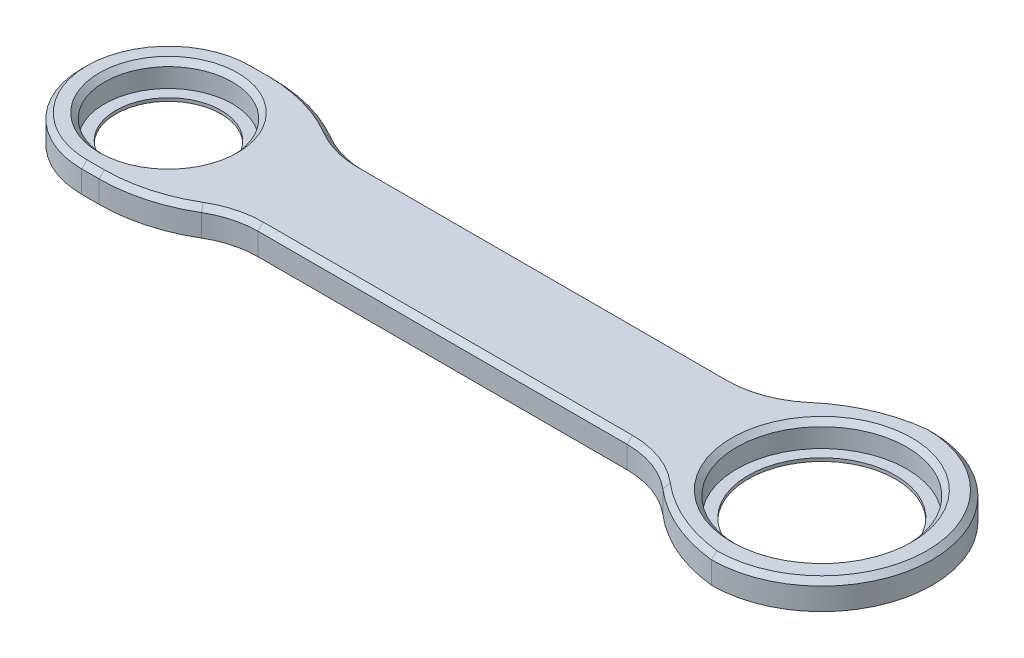
ISO-10303-21;
HEADER;
FILE_DESCRIPTION(('STEP AP214'),'2;1');
FILE_NAME('part.step','',(''),(''),'','','');
FILE_SCHEMA(('AUTOMOTIVE_DESIGN { 1 0 10303 214 1 1 1 1 }'));
ENDSEC;
DATA;
#1=APPLICATION_CONTEXT('core data for automotive mechanical design processes');
#2=APPLICATION_PROTOCOL_DEFINITION('international standard','automotive_design',2000,#1);
#3=PRODUCT_CONTEXT('',#1,'mechanical');
#4=PRODUCT('Part','Part','',(#3));
#5=PRODUCT_RELATED_PRODUCT_CATEGORY('part','',(#4));
#6=PRODUCT_DEFINITION_FORMATION('','',#4);
#7=PRODUCT_DEFINITION_CONTEXT('part definition',#1,'design');
#8=PRODUCT_DEFINITION('design','',#6,#7);
#9=PRODUCT_DEFINITION_SHAPE('','',#8);
#10=(LENGTH_UNIT() NAMED_UNIT(*) SI_UNIT(.MILLI.,.METRE.));
#11=(NAMED_UNIT(*) PLANE_ANGLE_UNIT() SI_UNIT($,.RADIAN.));
#12=(NAMED_UNIT(*) SI_UNIT($,.STERADIAN.) SOLID_ANGLE_UNIT());
#13=UNCERTAINTY_MEASURE_WITH_UNIT(LENGTH_MEASURE(1.E-05),#10,'distance_accuracy_value','');
#14=(GEOMETRIC_REPRESENTATION_CONTEXT(3) GLOBAL_UNCERTAINTY_ASSIGNED_CONTEXT((#13)) GLOBAL_UNIT_ASSIGNED_CONTEXT((#10,
#11,#12)) REPRESENTATION_CONTEXT('',''));
#15=CARTESIAN_POINT('',(0.,0.,0.));
#16=DIRECTION('',(0.,0.,1.));
#17=DIRECTION('',(1.,0.,0.));
#18=AXIS2_PLACEMENT_3D('',#15,#16,#17);
#19=CARTESIAN_POINT('',(62.125,5.2,0.));
#20=DIRECTION('',(0.,-1.,0.));
#21=DIRECTION('',(0.,0.,-1.));
#22=AXIS2_PLACEMENT_3D('',#19,#20,#21);
#23=CYLINDRICAL_SURFACE('',#22,16.15);
#24=CARTESIAN_POINT('',(62.125,4.19999999999999,0.));
#25=DIRECTION('',(0.,1.,0.));
#26=DIRECTION('',(0.,0.,1.));
#27=AXIS2_PLACEMENT_3D('',#24,#25,#26);
#28=CIRCLE('',#27,16.15);
#29=CARTESIAN_POINT('',(62.125,4.19999999999999,16.15));
#30=VERTEX_POINT('',#29);
#31=EDGE_CURVE('E316',#30,#30,#28,.T.);
#32=ORIENTED_EDGE('',*,*,#31,.T.);
#33=EDGE_LOOP('',(#32));
#34=FACE_BOUND('',#33,.T.);
#35=CARTESIAN_POINT('',(62.125,0.6,0.));
#36=DIRECTION('',(0.,-1.,0.));
#37=DIRECTION('',(0.,0.,-1.));
#38=AXIS2_PLACEMENT_3D('',#35,#36,#37);
#39=CIRCLE('',#38,16.15);
#40=CARTESIAN_POINT('',(62.125,0.6,-16.15));
#41=VERTEX_POINT('',#40);
#42=EDGE_CURVE('E46',#41,#41,#39,.T.);
#43=ORIENTED_EDGE('',*,*,#42,.T.);
#44=EDGE_LOOP('',(#43));
#45=FACE_BOUND('',#44,.T.);
#46=ADVANCED_FACE('F41',(#34,#45),#23,.F.);
#47=CARTESIAN_POINT('',(-62.125,5.2,0.));
#48=DIRECTION('',(0.,-1.,0.));
#49=DIRECTION('',(0.,0.,-1.));
#50=AXIS2_PLACEMENT_3D('',#47,#48,#49);
#51=CYLINDRICAL_SURFACE('',#50,12.15);
#52=CARTESIAN_POINT('',(-62.125,4.2,0.));
#53=DIRECTION('',(0.,1.,0.));
#54=DIRECTION('',(0.,0.,1.));
#55=AXIS2_PLACEMENT_3D('',#52,#53,#54);
#56=CIRCLE('',#55,12.15);
#57=CARTESIAN_POINT('',(-62.125,4.2,12.15));
#58=VERTEX_POINT('',#57);
#59=EDGE_CURVE('E319',#58,#58,#56,.T.);
#60=ORIENTED_EDGE('',*,*,#59,.T.);
#61=EDGE_LOOP('',(#60));
#62=FACE_BOUND('',#61,.T.);
#63=CARTESIAN_POINT('',(-62.125,0.6,0.));
#64=DIRECTION('',(0.,-1.,0.));
#65=DIRECTION('',(0.,0.,-1.));
#66=AXIS2_PLACEMENT_3D('',#63,#64,#65);
#67=CIRCLE('',#66,12.15);
#68=CARTESIAN_POINT('',(-62.125,0.6,-12.15));
#69=VERTEX_POINT('',#68);
#70=EDGE_CURVE('E351',#69,#69,#67,.T.);
#71=ORIENTED_EDGE('',*,*,#70,.T.);
#72=EDGE_LOOP('',(#71));
#73=FACE_BOUND('',#72,.T.);
#74=ADVANCED_FACE('F469',(#62,#73),#51,.F.);
#75=CARTESIAN_POINT('',(35.1066134191231,5.2,26.5457507457693));
#76=DIRECTION('',(0.,-1.,0.));
#77=DIRECTION('',(0.,0.,-1.));
#78=AXIS2_PLACEMENT_3D('',#75,#76,#77);
#79=CYLINDRICAL_SURFACE('',#78,16.5457507457693);
#80=DIRECTION('',(0.,-1.,0.));
#81=VECTOR('',#80,1.);
#82=CARTESIAN_POINT('',(45.8618438003382,5.2,13.9724899440475));
#83=LINE('',#82,#81);
#84=CARTESIAN_POINT('',(45.8618438003382,0.,13.9724899440475));
#85=VERTEX_POINT('',#84);
#86=CARTESIAN_POINT('',(45.8618438003382,4.2,13.9724899440475));
#87=VERTEX_POINT('',#86);
#88=EDGE_CURVE('E274',#85,#87,#83,.F.);
#89=ORIENTED_EDGE('',*,*,#88,.T.);
#90=CARTESIAN_POINT('',(35.1066134191231,4.2,26.5457507457693));
#91=DIRECTION('',(0.,1.,0.));
#92=DIRECTION('',(0.,0.,1.));
#93=AXIS2_PLACEMENT_3D('',#90,#91,#92);
#94=CIRCLE('',#93,16.5457507457693);
#95=CARTESIAN_POINT('',(35.106613419123,4.2,9.99999999999998));
#96=VERTEX_POINT('',#95);
#97=EDGE_CURVE('E51',#87,#96,#94,.T.);
#98=ORIENTED_EDGE('',*,*,#97,.T.);
#99=DIRECTION('',(0.,-1.,0.));
#100=VECTOR('',#99,1.);
#101=CARTESIAN_POINT('',(35.106613419123,5.2,9.99999999999998));
#102=LINE('',#101,#100);
#103=CARTESIAN_POINT('',(35.106613419123,0.,9.99999999999998));
#104=VERTEX_POINT('',#103);
#105=EDGE_CURVE('E241',#96,#104,#102,.T.);
#106=ORIENTED_EDGE('',*,*,#105,.T.);
#107=CARTESIAN_POINT('',(35.1066134191231,0.,26.5457507457693));
#108=DIRECTION('',(0.,1.,0.));
#109=DIRECTION('',(0.,0.,1.));
#110=AXIS2_PLACEMENT_3D('',#107,#108,#109);
#111=CIRCLE('',#110,16.5457507457693);
#112=EDGE_CURVE('E219',#85,#104,#111,.T.);
#113=ORIENTED_EDGE('',*,*,#112,.F.);
#114=EDGE_LOOP('',(#89,#98,#106,#113));
#115=FACE_BOUND('',#114,.T.);
#116=ADVANCED_FACE('F475',(#115),#79,.F.);
#117=CARTESIAN_POINT('',(62.125,5.2,0.));
#118=DIRECTION('',(0.,-1.,0.));
#119=DIRECTION('',(0.,0.,-1.));
#120=AXIS2_PLACEMENT_3D('',#117,#118,#119);
#121=CYLINDRICAL_SURFACE('',#120,21.);
#122=DIRECTION('',(0.,-1.,0.));
#123=VECTOR('',#122,1.);
#124=CARTESIAN_POINT('',(62.125,5.2,-21.));
#125=LINE('',#124,#123);
#126=CARTESIAN_POINT('',(62.125,4.2,-21.));
#127=VERTEX_POINT('',#126);
#128=CARTESIAN_POINT('',(62.125,0.,-21.));
#129=VERTEX_POINT('',#128);
#130=EDGE_CURVE('E249',#127,#129,#125,.T.);
#131=ORIENTED_EDGE('',*,*,#130,.F.);
#132=CARTESIAN_POINT('',(62.125,4.2,0.));
#133=DIRECTION('',(0.,1.,0.));
#134=DIRECTION('',(0.,0.,1.));
#135=AXIS2_PLACEMENT_3D('',#132,#133,#134);
#136=CIRCLE('',#135,21.);
#137=CARTESIAN_POINT('',(62.125,4.2,21.));
#138=VERTEX_POINT('',#137);
#139=EDGE_CURVE('E311',#127,#138,#136,.F.);
#140=ORIENTED_EDGE('',*,*,#139,.T.);
#141=DIRECTION('',(0.,-1.,0.));
#142=VECTOR('',#141,1.);
#143=CARTESIAN_POINT('',(62.125,5.2,21.));
#144=LINE('',#143,#142);
#145=CARTESIAN_POINT('',(62.125,0.,21.));
#146=VERTEX_POINT('',#145);
#147=EDGE_CURVE('E251',#138,#146,#144,.T.);
#148=ORIENTED_EDGE('',*,*,#147,.T.);
#149=CARTESIAN_POINT('',(62.125,0.,0.));
#150=DIRECTION('',(0.,1.,0.));
#151=DIRECTION('',(0.,0.,1.));
#152=AXIS2_PLACEMENT_3D('',#149,#150,#151);
#153=CIRCLE('',#152,21.);
#154=EDGE_CURVE('E223',#146,#129,#153,.T.);
#155=ORIENTED_EDGE('',*,*,#154,.T.);
#156=EDGE_LOOP('',(#131,#140,#148,#155));
#157=FACE_BOUND('',#156,.T.);
#158=ADVANCED_FACE('F504',(#157),#121,.T.);
#159=CARTESIAN_POINT('',(35.1066134191231,5.2,-26.5457507457693));
#160=DIRECTION('',(0.,-1.,0.));
#161=DIRECTION('',(0.,0.,-1.));
#162=AXIS2_PLACEMENT_3D('',#159,#160,#161);
#163=CYLINDRICAL_SURFACE('',#162,16.5457507457693);
#164=DIRECTION('',(0.,-1.,0.));
#165=VECTOR('',#164,1.);
#166=CARTESIAN_POINT('',(35.106613419123,5.2,-9.99999999999999));
#167=LINE('',#166,#165);
#168=CARTESIAN_POINT('',(35.106613419123,4.2,-9.99999999999999));
#169=VERTEX_POINT('',#168);
#170=CARTESIAN_POINT('',(35.106613419123,0.,-9.99999999999999));
#171=VERTEX_POINT('',#170);
#172=EDGE_CURVE('E247',#169,#171,#167,.T.);
#173=ORIENTED_EDGE('',*,*,#172,.F.);
#174=CARTESIAN_POINT('',(35.1066134191231,4.2,-26.5457507457693));
#175=DIRECTION('',(0.,1.,0.));
#176=DIRECTION('',(0.,0.,1.));
#177=AXIS2_PLACEMENT_3D('',#174,#175,#176);
#178=CIRCLE('',#177,16.5457507457693);
#179=CARTESIAN_POINT('',(45.8618438003381,4.2,-13.9724899440475));
#180=VERTEX_POINT('',#179);
#181=EDGE_CURVE('E324',#169,#180,#178,.T.);
#182=ORIENTED_EDGE('',*,*,#181,.T.);
#183=DIRECTION('',(0.,-1.,0.));
#184=VECTOR('',#183,1.);
#185=CARTESIAN_POINT('',(45.8618438003381,5.2,-13.9724899440475));
#186=LINE('',#185,#184);
#187=CARTESIAN_POINT('',(45.8618438003381,0.,-13.9724899440475));
#188=VERTEX_POINT('',#187);
#189=EDGE_CURVE('E272',#180,#188,#186,.T.);
#190=ORIENTED_EDGE('',*,*,#189,.T.);
#191=CARTESIAN_POINT('',(35.1066134191231,0.,-26.5457507457693));
#192=DIRECTION('',(0.,1.,0.));
#193=DIRECTION('',(0.,0.,1.));
#194=AXIS2_PLACEMENT_3D('',#191,#192,#193);
#195=CIRCLE('',#194,16.5457507457693);
#196=EDGE_CURVE('E226',#171,#188,#195,.T.);
#197=ORIENTED_EDGE('',*,*,#196,.F.);
#198=EDGE_LOOP('',(#173,#182,#190,#197));
#199=FACE_BOUND('',#198,.T.);
#200=ADVANCED_FACE('F612',(#199),#163,.F.);
#201=CARTESIAN_POINT('',(0.,5.2,-9.99999999999999));
#202=DIRECTION('',(0.,0.,-1.));
#203=DIRECTION('',(-1.,0.,0.));
#204=AXIS2_PLACEMENT_3D('',#201,#202,#203);
#205=PLANE('',#204);
#206=DIRECTION('',(0.,-1.,0.));
#207=VECTOR('',#206,1.);
#208=CARTESIAN_POINT('',(-35.106613419123,5.2,-9.99999999999999));
#209=LINE('',#208,#207);
#210=CARTESIAN_POINT('',(-35.106613419123,4.2,-9.99999999999999));
#211=VERTEX_POINT('',#210);
#212=CARTESIAN_POINT('',(-35.106613419123,0.,-9.99999999999999));
#213=VERTEX_POINT('',#212);
#214=EDGE_CURVE('E245',#211,#213,#209,.T.);
#215=ORIENTED_EDGE('',*,*,#214,.F.);
#216=DIRECTION('',(1.,0.,0.));
#217=VECTOR('',#216,1.);
#218=CARTESIAN_POINT('',(0.,4.20000000000001,-9.99999999999999));
#219=LINE('',#218,#217);
#220=EDGE_CURVE('E314',#211,#169,#219,.T.);
#221=ORIENTED_EDGE('',*,*,#220,.T.);
#222=ORIENTED_EDGE('',*,*,#172,.T.);
#223=DIRECTION('',(1.,0.,0.));
#224=VECTOR('',#223,1.);
#225=CARTESIAN_POINT('',(0.,0.,-9.99999999999999));
#226=LINE('',#225,#224);
#227=EDGE_CURVE('E229',#213,#171,#226,.T.);
#228=ORIENTED_EDGE('',*,*,#227,.F.);
#229=EDGE_LOOP('',(#215,#221,#222,#228));
#230=FACE_BOUND('',#229,.T.);
#231=ADVANCED_FACE('F608',(#230),#205,.T.);
#232=CARTESIAN_POINT('',(-35.1066134191231,5.2,-26.5457507457693));
#233=DIRECTION('',(0.,-1.,0.));
#234=DIRECTION('',(0.,0.,-1.));
#235=AXIS2_PLACEMENT_3D('',#232,#233,#234);
#236=CYLINDRICAL_SURFACE('',#235,16.5457507457693);
#237=DIRECTION('',(0.,-1.,0.));
#238=VECTOR('',#237,1.);
#239=CARTESIAN_POINT('',(-43.5399755911029,5.2,-12.3105735351637));
#240=LINE('',#239,#238);
#241=CARTESIAN_POINT('',(-43.5399755911029,0.,-12.3105735351637));
#242=VERTEX_POINT('',#241);
#243=CARTESIAN_POINT('',(-43.5399755911029,4.2,-12.3105735351637));
#244=VERTEX_POINT('',#243);
#245=EDGE_CURVE('E264',#242,#244,#240,.F.);
#246=ORIENTED_EDGE('',*,*,#245,.T.);
#247=CARTESIAN_POINT('',(-35.1066134191231,4.2,-26.5457507457693));
#248=DIRECTION('',(0.,1.,0.));
#249=DIRECTION('',(0.,0.,1.));
#250=AXIS2_PLACEMENT_3D('',#247,#248,#249);
#251=CIRCLE('',#250,16.5457507457693);
#252=EDGE_CURVE('E326',#244,#211,#251,.T.);
#253=ORIENTED_EDGE('',*,*,#252,.T.);
#254=ORIENTED_EDGE('',*,*,#214,.T.);
#255=CARTESIAN_POINT('',(-35.1066134191231,0.,-26.5457507457693));
#256=DIRECTION('',(0.,1.,0.));
#257=DIRECTION('',(0.,0.,1.));
#258=AXIS2_PLACEMENT_3D('',#255,#256,#257);
#259=CIRCLE('',#258,16.5457507457693);
#260=EDGE_CURVE('E232',#242,#213,#259,.T.);
#261=ORIENTED_EDGE('',*,*,#260,.F.);
#262=EDGE_LOOP('',(#246,#253,#254,#261));
#263=FACE_BOUND('',#262,.T.);
#264=ADVANCED_FACE('F604',(#263),#236,.F.);
#265=CARTESIAN_POINT('',(-35.1066134191231,5.2,26.5457507457693));
#266=DIRECTION('',(0.,-1.,0.));
#267=DIRECTION('',(0.,0.,-1.));
#268=AXIS2_PLACEMENT_3D('',#265,#266,#267);
#269=CYLINDRICAL_SURFACE('',#268,16.5457507457693);
#270=DIRECTION('',(0.,-1.,0.));
#271=VECTOR('',#270,1.);
#272=CARTESIAN_POINT('',(-35.106613419123,5.2,9.99999999999998));
#273=LINE('',#272,#271);
#274=CARTESIAN_POINT('',(-35.106613419123,4.2,9.99999999999998));
#275=VERTEX_POINT('',#274);
#276=CARTESIAN_POINT('',(-35.106613419123,0.,9.99999999999998));
#277=VERTEX_POINT('',#276);
#278=EDGE_CURVE('E243',#275,#277,#273,.T.);
#279=ORIENTED_EDGE('',*,*,#278,.F.);
#280=CARTESIAN_POINT('',(-35.1066134191231,4.2,26.5457507457693));
#281=DIRECTION('',(0.,1.,0.));
#282=DIRECTION('',(0.,0.,1.));
#283=AXIS2_PLACEMENT_3D('',#280,#281,#282);
#284=CIRCLE('',#283,16.5457507457693);
#285=CARTESIAN_POINT('',(-43.5399755911029,4.2,12.3105735351637));
#286=VERTEX_POINT('',#285);
#287=EDGE_CURVE('E339',#275,#286,#284,.T.);
#288=ORIENTED_EDGE('',*,*,#287,.T.);
#289=DIRECTION('',(0.,-1.,0.));
#290=VECTOR('',#289,1.);
#291=CARTESIAN_POINT('',(-43.5399755911029,5.2,12.3105735351637));
#292=LINE('',#291,#290);
#293=CARTESIAN_POINT('',(-43.5399755911029,0.,12.3105735351637));
#294=VERTEX_POINT('',#293);
#295=EDGE_CURVE('E270',#286,#294,#292,.T.);
#296=ORIENTED_EDGE('',*,*,#295,.T.);
#297=CARTESIAN_POINT('',(-35.1066134191231,0.,26.5457507457693));
#298=DIRECTION('',(0.,1.,0.));
#299=DIRECTION('',(0.,0.,1.));
#300=AXIS2_PLACEMENT_3D('',#297,#298,#299);
#301=CIRCLE('',#300,16.5457507457693);
#302=EDGE_CURVE('E235',#277,#294,#301,.T.);
#303=ORIENTED_EDGE('',*,*,#302,.F.);
#304=EDGE_LOOP('',(#279,#288,#296,#303));
#305=FACE_BOUND('',#304,.T.);
#306=ADVANCED_FACE('F601',(#305),#269,.F.);
#307=CARTESIAN_POINT('',(0.,5.2,9.99999999999998));
#308=DIRECTION('',(0.,0.,-1.));
#309=DIRECTION('',(-1.,0.,0.));
#310=AXIS2_PLACEMENT_3D('',#307,#308,#309);
#311=PLANE('',#310);
#312=ORIENTED_EDGE('',*,*,#105,.F.);
#313=DIRECTION('',(-1.,0.,0.));
#314=VECTOR('',#313,1.);
#315=CARTESIAN_POINT('',(-35.106613419123,4.2,9.99999999999998));
#316=LINE('',#315,#314);
#317=EDGE_CURVE('E11',#96,#275,#316,.T.);
#318=ORIENTED_EDGE('',*,*,#317,.T.);
#319=ORIENTED_EDGE('',*,*,#278,.T.);
#320=DIRECTION('',(1.,0.,0.));
#321=VECTOR('',#320,1.);
#322=CARTESIAN_POINT('',(0.,0.,9.99999999999998));
#323=LINE('',#322,#321);
#324=EDGE_CURVE('E238',#277,#104,#323,.T.);
#325=ORIENTED_EDGE('',*,*,#324,.T.);
#326=EDGE_LOOP('',(#312,#318,#319,#325));
#327=FACE_BOUND('',#326,.T.);
#328=ADVANCED_FACE('F595',(#327),#311,.F.);
#329=CARTESIAN_POINT('',(0.,5.2,0.));
#330=DIRECTION('',(0.,1.,0.));
#331=DIRECTION('',(0.,0.,1.));
#332=AXIS2_PLACEMENT_3D('',#329,#330,#331);
#333=PLANE('',#332);
#334=CARTESIAN_POINT('',(62.125,5.2,0.));
#335=DIRECTION('',(0.,1.,0.));
#336=DIRECTION('',(0.,0.,1.));
#337=AXIS2_PLACEMENT_3D('',#334,#335,#336);
#338=CIRCLE('',#337,17.15);
#339=CARTESIAN_POINT('',(62.125,5.2,17.15));
#340=VERTEX_POINT('',#339);
#341=EDGE_CURVE('E308',#340,#340,#338,.F.);
#342=ORIENTED_EDGE('',*,*,#341,.T.);
#343=EDGE_LOOP('',(#342));
#344=FACE_BOUND('',#343,.T.);
#345=CARTESIAN_POINT('',(-62.125,5.2,0.));
#346=DIRECTION('',(0.,1.,0.));
#347=DIRECTION('',(0.,0.,1.));
#348=AXIS2_PLACEMENT_3D('',#345,#346,#347);
#349=CIRCLE('',#348,13.15);
#350=CARTESIAN_POINT('',(-62.125,5.2,13.15));
#351=VERTEX_POINT('',#350);
#352=EDGE_CURVE('E305',#351,#351,#349,.F.);
#353=ORIENTED_EDGE('',*,*,#352,.T.);
#354=EDGE_LOOP('',(#353));
#355=FACE_BOUND('',#354,.T.);
#356=CARTESIAN_POINT('',(62.125,5.2,0.));
#357=DIRECTION('',(0.,1.,0.));
#358=DIRECTION('',(0.,0.,1.));
#359=AXIS2_PLACEMENT_3D('',#356,#357,#358);
#360=CIRCLE('',#359,20.);
#361=CARTESIAN_POINT('',(62.1789222081054,5.2,19.9999273097547));
#362=VERTEX_POINT('',#361);
#363=CARTESIAN_POINT('',(62.1789222081054,5.2,-19.9999273097547));
#364=VERTEX_POINT('',#363);
#365=EDGE_CURVE('E298',#362,#364,#360,.T.);
#366=ORIENTED_EDGE('',*,*,#365,.T.);
#367=CARTESIAN_POINT('',(65.3627365911324,5.2,8.82477261885566));
#368=DIRECTION('',(0.,1.,0.));
#369=DIRECTION('',(0.,0.,1.));
#370=AXIS2_PLACEMENT_3D('',#367,#368,#369);
#371=CIRCLE('',#370,29.);
#372=CARTESIAN_POINT('',(46.5118735600313,5.2,-13.2125811919507));
#373=VERTEX_POINT('',#372);
#374=EDGE_CURVE('E303',#364,#373,#371,.T.);
#375=ORIENTED_EDGE('',*,*,#374,.T.);
#376=CARTESIAN_POINT('',(35.1066134191231,5.2,-26.5457507457693));
#377=DIRECTION('',(0.,1.,0.));
#378=DIRECTION('',(0.,0.,1.));
#379=AXIS2_PLACEMENT_3D('',#376,#377,#378);
#380=CIRCLE('',#379,17.5457507457693);
#381=CARTESIAN_POINT('',(35.106613419123,5.2,-8.99999999999999));
#382=VERTEX_POINT('',#381);
#383=EDGE_CURVE('E301',#373,#382,#380,.F.);
#384=ORIENTED_EDGE('',*,*,#383,.T.);
#385=DIRECTION('',(-1.,0.,0.));
#386=VECTOR('',#385,1.);
#387=CARTESIAN_POINT('',(0.,5.2,-8.99999999999999));
#388=LINE('',#387,#386);
#389=CARTESIAN_POINT('',(-35.106613419123,5.2,-9.));
#390=VERTEX_POINT('',#389);
#391=EDGE_CURVE('E296',#382,#390,#388,.T.);
#392=ORIENTED_EDGE('',*,*,#391,.T.);
#393=CARTESIAN_POINT('',(-35.1066134191231,5.2,-26.5457507457693));
#394=DIRECTION('',(0.,1.,0.));
#395=DIRECTION('',(0.,0.,1.));
#396=AXIS2_PLACEMENT_3D('',#393,#394,#395);
#397=CIRCLE('',#396,17.5457507457693);
#398=CARTESIAN_POINT('',(-44.0496751690526,5.2,-11.4502210839916));
#399=VERTEX_POINT('',#398);
#400=EDGE_CURVE('E294',#390,#399,#397,.F.);
#401=ORIENTED_EDGE('',*,*,#400,.T.);
#402=CARTESIAN_POINT('',(-58.8309629295944,5.2,13.5));
#403=DIRECTION('',(0.,1.,0.));
#404=DIRECTION('',(0.,0.,1.));
#405=AXIS2_PLACEMENT_3D('',#402,#403,#404);
#406=CIRCLE('',#405,29.);
#407=CARTESIAN_POINT('',(-58.8309629295944,5.2,-15.5));
#408=VERTEX_POINT('',#407);
#409=EDGE_CURVE('E292',#399,#408,#406,.T.);
#410=ORIENTED_EDGE('',*,*,#409,.T.);
#411=DIRECTION('',(-1.,0.,0.));
#412=VECTOR('',#411,1.);
#413=CARTESIAN_POINT('',(-62.125,5.2,-15.5));
#414=LINE('',#413,#412);
#415=CARTESIAN_POINT('',(-62.125,5.2,-15.5));
#416=VERTEX_POINT('',#415);
#417=EDGE_CURVE('E290',#408,#416,#414,.T.);
#418=ORIENTED_EDGE('',*,*,#417,.T.);
#419=CARTESIAN_POINT('',(-62.125,5.2,0.));
#420=DIRECTION('',(0.,1.,0.));
#421=DIRECTION('',(0.,0.,1.));
#422=AXIS2_PLACEMENT_3D('',#419,#420,#421);
#423=CIRCLE('',#422,15.5);
#424=CARTESIAN_POINT('',(-62.125,5.2,15.5));
#425=VERTEX_POINT('',#424);
#426=EDGE_CURVE('E288',#416,#425,#423,.T.);
#427=ORIENTED_EDGE('',*,*,#426,.T.);
#428=DIRECTION('',(1.,0.,0.));
#429=VECTOR('',#428,1.);
#430=CARTESIAN_POINT('',(-58.8309629295944,5.2,15.5));
#431=LINE('',#430,#429);
#432=CARTESIAN_POINT('',(-58.8309629295944,5.2,15.5));
#433=VERTEX_POINT('',#432);
#434=EDGE_CURVE('E286',#425,#433,#431,.T.);
#435=ORIENTED_EDGE('',*,*,#434,.T.);
#436=CARTESIAN_POINT('',(-58.8309629295944,5.2,-13.5));
#437=DIRECTION('',(0.,1.,0.));
#438=DIRECTION('',(0.,0.,1.));
#439=AXIS2_PLACEMENT_3D('',#436,#437,#438);
#440=CIRCLE('',#439,29.);
#441=CARTESIAN_POINT('',(-44.0496751690526,5.2,11.4502210839916));
#442=VERTEX_POINT('',#441);
#443=EDGE_CURVE('E284',#433,#442,#440,.T.);
#444=ORIENTED_EDGE('',*,*,#443,.T.);
#445=CARTESIAN_POINT('',(-35.1066134191231,5.2,26.5457507457693));
#446=DIRECTION('',(0.,1.,0.));
#447=DIRECTION('',(0.,0.,1.));
#448=AXIS2_PLACEMENT_3D('',#445,#446,#447);
#449=CIRCLE('',#448,17.5457507457693);
#450=CARTESIAN_POINT('',(-35.106613419123,5.2,8.99999999999999));
#451=VERTEX_POINT('',#450);
#452=EDGE_CURVE('E280',#442,#451,#449,.F.);
#453=ORIENTED_EDGE('',*,*,#452,.T.);
#454=DIRECTION('',(1.,0.,0.));
#455=VECTOR('',#454,1.);
#456=CARTESIAN_POINT('',(35.106613419123,5.2,8.99999999999999));
#457=LINE('',#456,#455);
#458=CARTESIAN_POINT('',(35.106613419123,5.2,8.99999999999999));
#459=VERTEX_POINT('',#458);
#460=EDGE_CURVE('E276',#451,#459,#457,.T.);
#461=ORIENTED_EDGE('',*,*,#460,.T.);
#462=CARTESIAN_POINT('',(35.1066134191231,5.2,26.5457507457693));
#463=DIRECTION('',(0.,1.,0.));
#464=DIRECTION('',(0.,0.,1.));
#465=AXIS2_PLACEMENT_3D('',#462,#463,#464);
#466=CIRCLE('',#465,17.5457507457693);
#467=CARTESIAN_POINT('',(46.5118735600313,5.2,13.2125811919508));
#468=VERTEX_POINT('',#467);
#469=EDGE_CURVE('E278',#459,#468,#466,.F.);
#470=ORIENTED_EDGE('',*,*,#469,.T.);
#471=CARTESIAN_POINT('',(65.3627365911325,5.2,-8.82477261885563));
#472=DIRECTION('',(0.,1.,0.));
#473=DIRECTION('',(0.,0.,1.));
#474=AXIS2_PLACEMENT_3D('',#471,#472,#473);
#475=CIRCLE('',#474,29.);
#476=EDGE_CURVE('E282',#468,#362,#475,.T.);
#477=ORIENTED_EDGE('',*,*,#476,.T.);
#478=EDGE_LOOP('',(#366,#375,#384,#392,#401,#410,#418,#427,#435,#444,#453,#461,#470,#477));
#479=FACE_BOUND('',#478,.T.);
#480=ADVANCED_FACE('F517',(#344,#355,#479),#333,.T.);
#481=CARTESIAN_POINT('',(0.,0.,0.));
#482=DIRECTION('',(0.,1.,0.));
#483=DIRECTION('',(0.,0.,1.));
#484=AXIS2_PLACEMENT_3D('',#481,#482,#483);
#485=PLANE('',#484);
#486=DIRECTION('',(1.,0.,0.));
#487=VECTOR('',#486,1.);
#488=CARTESIAN_POINT('',(-62.125,0.,-16.5));
#489=LINE('',#488,#487);
#490=CARTESIAN_POINT('',(-62.125,0.,-16.5));
#491=VERTEX_POINT('',#490);
#492=CARTESIAN_POINT('',(-58.8309629295944,0.,-16.5));
#493=VERTEX_POINT('',#492);
#494=EDGE_CURVE('E196',#491,#493,#489,.T.);
#495=ORIENTED_EDGE('',*,*,#494,.T.);
#496=CARTESIAN_POINT('',(-58.8309629295944,0.,13.5));
#497=DIRECTION('',(0.,1.,0.));
#498=DIRECTION('',(0.,0.,1.));
#499=AXIS2_PLACEMENT_3D('',#496,#497,#498);
#500=CIRCLE('',#499,30.);
#501=EDGE_CURVE('E262',#493,#242,#500,.F.);
#502=ORIENTED_EDGE('',*,*,#501,.T.);
#503=ORIENTED_EDGE('',*,*,#260,.T.);
#504=ORIENTED_EDGE('',*,*,#227,.T.);
#505=ORIENTED_EDGE('',*,*,#196,.T.);
#506=CARTESIAN_POINT('',(65.3627365911324,0.,8.82477261885566));
#507=DIRECTION('',(0.,1.,0.));
#508=DIRECTION('',(0.,0.,1.));
#509=AXIS2_PLACEMENT_3D('',#506,#507,#508);
#510=CIRCLE('',#509,30.);
#511=EDGE_CURVE('E257',#188,#129,#510,.F.);
#512=ORIENTED_EDGE('',*,*,#511,.T.);
#513=ORIENTED_EDGE('',*,*,#154,.F.);
#514=CARTESIAN_POINT('',(65.3627365911325,0.,-8.82477261885563));
#515=DIRECTION('',(0.,1.,0.));
#516=DIRECTION('',(0.,0.,1.));
#517=AXIS2_PLACEMENT_3D('',#514,#515,#516);
#518=CIRCLE('',#517,30.);
#519=EDGE_CURVE('E255',#146,#85,#518,.F.);
#520=ORIENTED_EDGE('',*,*,#519,.T.);
#521=ORIENTED_EDGE('',*,*,#112,.T.);
#522=ORIENTED_EDGE('',*,*,#324,.F.);
#523=ORIENTED_EDGE('',*,*,#302,.T.);
#524=CARTESIAN_POINT('',(-58.8309629295944,0.,-13.5));
#525=DIRECTION('',(0.,1.,0.));
#526=DIRECTION('',(0.,0.,1.));
#527=AXIS2_PLACEMENT_3D('',#524,#525,#526);
#528=CIRCLE('',#527,30.);
#529=CARTESIAN_POINT('',(-58.8309629295944,0.,16.5));
#530=VERTEX_POINT('',#529);
#531=EDGE_CURVE('E260',#294,#530,#528,.F.);
#532=ORIENTED_EDGE('',*,*,#531,.T.);
#533=DIRECTION('',(-1.,0.,0.));
#534=VECTOR('',#533,1.);
#535=CARTESIAN_POINT('',(0.,0.,16.5));
#536=LINE('',#535,#534);
#537=CARTESIAN_POINT('',(-62.125,0.,16.5));
#538=VERTEX_POINT('',#537);
#539=EDGE_CURVE('E208',#530,#538,#536,.T.);
#540=ORIENTED_EDGE('',*,*,#539,.T.);
#541=CARTESIAN_POINT('',(-62.125,0.,0.));
#542=DIRECTION('',(0.,-1.,0.));
#543=DIRECTION('',(0.,0.,1.));
#544=AXIS2_PLACEMENT_3D('',#541,#542,#543);
#545=CIRCLE('',#544,16.5);
#546=EDGE_CURVE('E190',#538,#491,#545,.T.);
#547=ORIENTED_EDGE('',*,*,#546,.T.);
#548=EDGE_LOOP('',(#495,#502,#503,#504,#505,#512,#513,#520,#521,#522,#523,#532,#540,#547));
#549=FACE_BOUND('',#548,.T.);
#550=CARTESIAN_POINT('',(-62.125,0.,0.));
#551=DIRECTION('',(0.,-1.,0.));
#552=DIRECTION('',(0.,0.,-1.));
#553=AXIS2_PLACEMENT_3D('',#550,#551,#552);
#554=CIRCLE('',#553,10.);
#555=CARTESIAN_POINT('',(-62.125,0.,-9.99999999999999));
#556=VERTEX_POINT('',#555);
#557=EDGE_CURVE('E216',#556,#556,#554,.T.);
#558=ORIENTED_EDGE('',*,*,#557,.F.);
#559=EDGE_LOOP('',(#558));
#560=FACE_BOUND('',#559,.T.);
#561=CARTESIAN_POINT('',(62.125,0.,0.));
#562=DIRECTION('',(0.,-1.,0.));
#563=DIRECTION('',(0.,0.,-1.));
#564=AXIS2_PLACEMENT_3D('',#561,#562,#563);
#565=CIRCLE('',#564,14.);
#566=CARTESIAN_POINT('',(62.125,0.,-14.));
#567=VERTEX_POINT('',#566);
#568=EDGE_CURVE('E559',#567,#567,#565,.T.);
#569=ORIENTED_EDGE('',*,*,#568,.F.);
#570=EDGE_LOOP('',(#569));
#571=FACE_BOUND('',#570,.T.);
#572=ADVANCED_FACE('F205',(#549,#560,#571),#485,.F.);
#573=CARTESIAN_POINT('',(-62.125,0.,0.));
#574=DIRECTION('',(0.,1.,0.));
#575=DIRECTION('',(0.,0.,1.));
#576=AXIS2_PLACEMENT_3D('',#573,#574,#575);
#577=CYLINDRICAL_SURFACE('',#576,16.5);
#578=DIRECTION('',(0.,1.,0.));
#579=VECTOR('',#578,1.);
#580=CARTESIAN_POINT('',(-62.125,0.,16.5));
#581=LINE('',#580,#579);
#582=CARTESIAN_POINT('',(-62.125,4.2,16.5));
#583=VERTEX_POINT('',#582);
#584=EDGE_CURVE('E195',#538,#583,#581,.T.);
#585=ORIENTED_EDGE('',*,*,#584,.T.);
#586=CARTESIAN_POINT('',(-62.125,4.2,0.));
#587=DIRECTION('',(0.,1.,0.));
#588=DIRECTION('',(0.,0.,1.));
#589=AXIS2_PLACEMENT_3D('',#586,#587,#588);
#590=CIRCLE('',#589,16.5);
#591=CARTESIAN_POINT('',(-62.125,4.2,-16.5));
#592=VERTEX_POINT('',#591);
#593=EDGE_CURVE('E192',#583,#592,#590,.F.);
#594=ORIENTED_EDGE('',*,*,#593,.T.);
#595=DIRECTION('',(0.,1.,0.));
#596=VECTOR('',#595,1.);
#597=CARTESIAN_POINT('',(-62.125,0.,-16.5));
#598=LINE('',#597,#596);
#599=EDGE_CURVE('E185',#491,#592,#598,.T.);
#600=ORIENTED_EDGE('',*,*,#599,.F.);
#601=ORIENTED_EDGE('',*,*,#546,.F.);
#602=EDGE_LOOP('',(#585,#594,#600,#601));
#603=FACE_BOUND('',#602,.T.);
#604=ADVANCED_FACE('F188',(#603),#577,.T.);
#605=CARTESIAN_POINT('',(-38.9705431978449,0.,16.5));
#606=DIRECTION('',(0.,0.,-1.));
#607=DIRECTION('',(-1.,0.,0.));
#608=AXIS2_PLACEMENT_3D('',#605,#606,#607);
#609=PLANE('',#608);
#610=DIRECTION('',(0.,1.,0.));
#611=VECTOR('',#610,1.);
#612=CARTESIAN_POINT('',(-58.8309629295944,5.2,16.5));
#613=LINE('',#612,#611);
#614=CARTESIAN_POINT('',(-58.8309629295944,4.2,16.5));
#615=VERTEX_POINT('',#614);
#616=EDGE_CURVE('E267',#530,#615,#613,.T.);
#617=ORIENTED_EDGE('',*,*,#616,.T.);
#618=DIRECTION('',(-1.,0.,0.));
#619=VECTOR('',#618,1.);
#620=CARTESIAN_POINT('',(-62.125,4.2,16.5));
#621=LINE('',#620,#619);
#622=EDGE_CURVE('E333',#615,#583,#621,.T.);
#623=ORIENTED_EDGE('',*,*,#622,.T.);
#624=ORIENTED_EDGE('',*,*,#584,.F.);
#625=ORIENTED_EDGE('',*,*,#539,.F.);
#626=EDGE_LOOP('',(#617,#623,#624,#625));
#627=FACE_BOUND('',#626,.T.);
#628=ADVANCED_FACE('F585',(#627),#609,.F.);
#629=CARTESIAN_POINT('',(-62.125,0.,-16.5));
#630=DIRECTION('',(0.,0.,1.));
#631=DIRECTION('',(1.,0.,0.));
#632=AXIS2_PLACEMENT_3D('',#629,#630,#631);
#633=PLANE('',#632);
#634=ORIENTED_EDGE('',*,*,#599,.T.);
#635=DIRECTION('',(1.,0.,0.));
#636=VECTOR('',#635,1.);
#637=CARTESIAN_POINT('',(-58.8309629295944,4.2,-16.5));
#638=LINE('',#637,#636);
#639=CARTESIAN_POINT('',(-58.8309629295944,4.2,-16.5));
#640=VERTEX_POINT('',#639);
#641=EDGE_CURVE('E330',#592,#640,#638,.T.);
#642=ORIENTED_EDGE('',*,*,#641,.T.);
#643=DIRECTION('',(0.,1.,0.));
#644=VECTOR('',#643,1.);
#645=CARTESIAN_POINT('',(-58.8309629295944,0.,-16.5));
#646=LINE('',#645,#644);
#647=EDGE_CURVE('E201',#640,#493,#646,.F.);
#648=ORIENTED_EDGE('',*,*,#647,.T.);
#649=ORIENTED_EDGE('',*,*,#494,.F.);
#650=EDGE_LOOP('',(#634,#642,#648,#649));
#651=FACE_BOUND('',#650,.T.);
#652=ADVANCED_FACE('F199',(#651),#633,.F.);
#653=CARTESIAN_POINT('',(-58.8309629295944,5.2,13.5));
#654=DIRECTION('',(0.,-1.,0.));
#655=DIRECTION('',(0.,0.,-1.));
#656=AXIS2_PLACEMENT_3D('',#653,#654,#655);
#657=CYLINDRICAL_SURFACE('',#656,30.);
#658=ORIENTED_EDGE('',*,*,#647,.F.);
#659=CARTESIAN_POINT('',(-58.8309629295944,4.2,13.5));
#660=DIRECTION('',(0.,1.,0.));
#661=DIRECTION('',(0.,0.,1.));
#662=AXIS2_PLACEMENT_3D('',#659,#660,#661);
#663=CIRCLE('',#662,30.);
#664=EDGE_CURVE('E328',#640,#244,#663,.F.);
#665=ORIENTED_EDGE('',*,*,#664,.T.);
#666=ORIENTED_EDGE('',*,*,#245,.F.);
#667=ORIENTED_EDGE('',*,*,#501,.F.);
#668=EDGE_LOOP('',(#658,#665,#666,#667));
#669=FACE_BOUND('',#668,.T.);
#670=ADVANCED_FACE('F482',(#669),#657,.T.);
#671=CARTESIAN_POINT('',(-58.8309629295944,5.2,-13.5));
#672=DIRECTION('',(0.,-1.,0.));
#673=DIRECTION('',(0.,0.,-1.));
#674=AXIS2_PLACEMENT_3D('',#671,#672,#673);
#675=CYLINDRICAL_SURFACE('',#674,30.);
#676=ORIENTED_EDGE('',*,*,#295,.F.);
#677=CARTESIAN_POINT('',(-58.8309629295944,4.2,-13.5));
#678=DIRECTION('',(0.,1.,0.));
#679=DIRECTION('',(0.,0.,1.));
#680=AXIS2_PLACEMENT_3D('',#677,#678,#679);
#681=CIRCLE('',#680,30.);
#682=EDGE_CURVE('E335',#286,#615,#681,.F.);
#683=ORIENTED_EDGE('',*,*,#682,.T.);
#684=ORIENTED_EDGE('',*,*,#616,.F.);
#685=ORIENTED_EDGE('',*,*,#531,.F.);
#686=EDGE_LOOP('',(#676,#683,#684,#685));
#687=FACE_BOUND('',#686,.T.);
#688=ADVANCED_FACE('F485',(#687),#675,.T.);
#689=CARTESIAN_POINT('',(65.3627365911324,5.2,8.82477261885566));
#690=DIRECTION('',(0.,-1.,0.));
#691=DIRECTION('',(0.,0.,-1.));
#692=AXIS2_PLACEMENT_3D('',#689,#690,#691);
#693=CYLINDRICAL_SURFACE('',#692,30.);
#694=ORIENTED_EDGE('',*,*,#189,.F.);
#695=CARTESIAN_POINT('',(65.3627365911324,4.2,8.82477261885566));
#696=DIRECTION('',(0.,1.,0.));
#697=DIRECTION('',(0.,0.,1.));
#698=AXIS2_PLACEMENT_3D('',#695,#696,#697);
#699=CIRCLE('',#698,30.);
#700=EDGE_CURVE('E322',#180,#127,#699,.F.);
#701=ORIENTED_EDGE('',*,*,#700,.T.);
#702=ORIENTED_EDGE('',*,*,#130,.T.);
#703=ORIENTED_EDGE('',*,*,#511,.F.);
#704=EDGE_LOOP('',(#694,#701,#702,#703));
#705=FACE_BOUND('',#704,.T.);
#706=ADVANCED_FACE('F489',(#705),#693,.T.);
#707=CARTESIAN_POINT('',(65.3627365911325,5.2,-8.82477261885563));
#708=DIRECTION('',(0.,-1.,0.));
#709=DIRECTION('',(0.,0.,-1.));
#710=AXIS2_PLACEMENT_3D('',#707,#708,#709);
#711=CYLINDRICAL_SURFACE('',#710,30.);
#712=ORIENTED_EDGE('',*,*,#147,.F.);
#713=CARTESIAN_POINT('',(65.3627365911325,4.2,-8.82477261885563));
#714=DIRECTION('',(0.,1.,0.));
#715=DIRECTION('',(0.,0.,1.));
#716=AXIS2_PLACEMENT_3D('',#713,#714,#715);
#717=CIRCLE('',#716,30.);
#718=EDGE_CURVE('E337',#138,#87,#717,.F.);
#719=ORIENTED_EDGE('',*,*,#718,.T.);
#720=ORIENTED_EDGE('',*,*,#88,.F.);
#721=ORIENTED_EDGE('',*,*,#519,.F.);
#722=EDGE_LOOP('',(#712,#719,#720,#721));
#723=FACE_BOUND('',#722,.T.);
#724=ADVANCED_FACE('F454',(#723),#711,.T.);
#725=CARTESIAN_POINT('',(-62.125,4.2,0.));
#726=DIRECTION('',(0.,-1.,0.));
#727=DIRECTION('',(0.,0.,-1.));
#728=AXIS2_PLACEMENT_3D('',#725,#726,#727);
#729=CONICAL_SURFACE('',#728,16.5,0.785398163397441);
#730=DIRECTION('',(0.,0.707106781186552,0.707106781186543));
#731=VECTOR('',#730,1.);
#732=CARTESIAN_POINT('',(-62.125,4.2,-16.5));
#733=LINE('',#732,#731);
#734=EDGE_CURVE('E213',#592,#416,#733,.T.);
#735=ORIENTED_EDGE('',*,*,#734,.F.);
#736=ORIENTED_EDGE('',*,*,#593,.F.);
#737=DIRECTION('',(0.,-0.707106781186552,0.707106781186543));
#738=VECTOR('',#737,1.);
#739=CARTESIAN_POINT('',(-62.125,5.2,15.5));
#740=LINE('',#739,#738);
#741=EDGE_CURVE('E210',#425,#583,#740,.T.);
#742=ORIENTED_EDGE('',*,*,#741,.F.);
#743=ORIENTED_EDGE('',*,*,#426,.F.);
#744=EDGE_LOOP('',(#735,#736,#742,#743));
#745=FACE_BOUND('',#744,.T.);
#746=ADVANCED_FACE('F449',(#745),#729,.T.);
#747=CARTESIAN_POINT('',(-38.9705431978449,4.2,16.5));
#748=DIRECTION('',(0.,0.707106781186543,0.707106781186552));
#749=DIRECTION('',(1.,0.,0.));
#750=AXIS2_PLACEMENT_3D('',#747,#748,#749);
#751=PLANE('',#750);
#752=ORIENTED_EDGE('',*,*,#741,.T.);
#753=ORIENTED_EDGE('',*,*,#622,.F.);
#754=DIRECTION('',(0.,-0.707106781186552,0.707106781186543));
#755=VECTOR('',#754,1.);
#756=CARTESIAN_POINT('',(-58.8309629295944,5.2,15.5));
#757=LINE('',#756,#755);
#758=EDGE_CURVE('E546',#433,#615,#757,.T.);
#759=ORIENTED_EDGE('',*,*,#758,.F.);
#760=ORIENTED_EDGE('',*,*,#434,.F.);
#761=EDGE_LOOP('',(#752,#753,#759,#760));
#762=FACE_BOUND('',#761,.T.);
#763=ADVANCED_FACE('F442',(#762),#751,.T.);
#764=CARTESIAN_POINT('',(-62.125,4.2,-16.5));
#765=DIRECTION('',(0.,0.707106781186543,-0.707106781186552));
#766=DIRECTION('',(-1.,0.,0.));
#767=AXIS2_PLACEMENT_3D('',#764,#765,#766);
#768=PLANE('',#767);
#769=ORIENTED_EDGE('',*,*,#734,.T.);
#770=ORIENTED_EDGE('',*,*,#417,.F.);
#771=DIRECTION('',(0.,0.707106781186552,0.707106781186543));
#772=VECTOR('',#771,1.);
#773=CARTESIAN_POINT('',(-58.8309629295944,4.2,-16.5));
#774=LINE('',#773,#772);
#775=EDGE_CURVE('E543',#640,#408,#774,.T.);
#776=ORIENTED_EDGE('',*,*,#775,.F.);
#777=ORIENTED_EDGE('',*,*,#641,.F.);
#778=EDGE_LOOP('',(#769,#770,#776,#777));
#779=FACE_BOUND('',#778,.T.);
#780=ADVANCED_FACE('F435',(#779),#768,.T.);
#781=CARTESIAN_POINT('',(-58.8309629295944,5.2,-13.5));
#782=DIRECTION('',(0.,-1.,0.));
#783=DIRECTION('',(0.,0.,-1.));
#784=AXIS2_PLACEMENT_3D('',#781,#782,#783);
#785=CONICAL_SURFACE('',#784,29.,0.785398163397441);
#786=ORIENTED_EDGE('',*,*,#758,.T.);
#787=ORIENTED_EDGE('',*,*,#682,.F.);
#788=DIRECTION('',(0.360412027936165,-0.707106781186553,0.60836105243427));
#789=VECTOR('',#788,1.);
#790=CARTESIAN_POINT('',(-44.0496751690526,5.2,11.4502210839916));
#791=LINE('',#790,#789);
#792=EDGE_CURVE('E540',#442,#286,#791,.T.);
#793=ORIENTED_EDGE('',*,*,#792,.F.);
#794=ORIENTED_EDGE('',*,*,#443,.F.);
#795=EDGE_LOOP('',(#786,#787,#793,#794));
#796=FACE_BOUND('',#795,.T.);
#797=ADVANCED_FACE('F428',(#796),#785,.T.);
#798=CARTESIAN_POINT('',(-58.8309629295944,5.2,13.5));
#799=DIRECTION('',(0.,-1.,0.));
#800=DIRECTION('',(0.,0.,-1.));
#801=AXIS2_PLACEMENT_3D('',#798,#799,#800);
#802=CONICAL_SURFACE('',#801,29.,0.78539816339744);
#803=ORIENTED_EDGE('',*,*,#775,.T.);
#804=ORIENTED_EDGE('',*,*,#409,.F.);
#805=DIRECTION('',(-0.360412027936165,0.707106781186554,0.608361052434269));
#806=VECTOR('',#805,1.);
#807=CARTESIAN_POINT('',(-43.5399755911029,4.2,-12.3105735351637));
#808=LINE('',#807,#806);
#809=EDGE_CURVE('E537',#244,#399,#808,.T.);
#810=ORIENTED_EDGE('',*,*,#809,.F.);
#811=ORIENTED_EDGE('',*,*,#664,.F.);
#812=EDGE_LOOP('',(#803,#804,#810,#811));
#813=FACE_BOUND('',#812,.T.);
#814=ADVANCED_FACE('F421',(#813),#802,.T.);
#815=CARTESIAN_POINT('',(-35.1066134191231,4.2,26.5457507457693));
#816=DIRECTION('',(0.,1.,0.));
#817=DIRECTION('',(0.,0.,1.));
#818=AXIS2_PLACEMENT_3D('',#815,#816,#817);
#819=CONICAL_SURFACE('',#818,16.5457507457693,0.785398163397441);
#820=ORIENTED_EDGE('',*,*,#792,.T.);
#821=ORIENTED_EDGE('',*,*,#287,.F.);
#822=DIRECTION('',(0.,-0.707106781186552,0.707106781186543));
#823=VECTOR('',#822,1.);
#824=CARTESIAN_POINT('',(-35.106613419123,5.2,8.99999999999999));
#825=LINE('',#824,#823);
#826=EDGE_CURVE('E534',#451,#275,#825,.T.);
#827=ORIENTED_EDGE('',*,*,#826,.F.);
#828=ORIENTED_EDGE('',*,*,#452,.F.);
#829=EDGE_LOOP('',(#820,#821,#827,#828));
#830=FACE_BOUND('',#829,.T.);
#831=ADVANCED_FACE('F414',(#830),#819,.F.);
#832=CARTESIAN_POINT('',(-35.1066134191231,4.2,-26.5457507457693));
#833=DIRECTION('',(0.,1.,0.));
#834=DIRECTION('',(0.,0.,1.));
#835=AXIS2_PLACEMENT_3D('',#832,#833,#834);
#836=CONICAL_SURFACE('',#835,16.5457507457693,0.785398163397441);
#837=ORIENTED_EDGE('',*,*,#809,.T.);
#838=ORIENTED_EDGE('',*,*,#400,.F.);
#839=DIRECTION('',(0.,0.707106781186552,0.707106781186543));
#840=VECTOR('',#839,1.);
#841=CARTESIAN_POINT('',(-35.106613419123,4.2,-9.99999999999998));
#842=LINE('',#841,#840);
#843=EDGE_CURVE('E531',#211,#390,#842,.T.);
#844=ORIENTED_EDGE('',*,*,#843,.F.);
#845=ORIENTED_EDGE('',*,*,#252,.F.);
#846=EDGE_LOOP('',(#837,#838,#844,#845));
#847=FACE_BOUND('',#846,.T.);
#848=ADVANCED_FACE('F407',(#847),#836,.F.);
#849=CARTESIAN_POINT('',(0.,5.2,8.99999999999999));
#850=DIRECTION('',(0.,0.707106781186543,0.707106781186552));
#851=DIRECTION('',(-1.,0.,0.));
#852=AXIS2_PLACEMENT_3D('',#849,#850,#851);
#853=PLANE('',#852);
#854=ORIENTED_EDGE('',*,*,#826,.T.);
#855=ORIENTED_EDGE('',*,*,#317,.F.);
#856=DIRECTION('',(0.,-0.707106781186552,0.707106781186543));
#857=VECTOR('',#856,1.);
#858=CARTESIAN_POINT('',(35.106613419123,5.2,8.99999999999999));
#859=LINE('',#858,#857);
#860=EDGE_CURVE('E528',#459,#96,#859,.T.);
#861=ORIENTED_EDGE('',*,*,#860,.F.);
#862=ORIENTED_EDGE('',*,*,#460,.F.);
#863=EDGE_LOOP('',(#854,#855,#861,#862));
#864=FACE_BOUND('',#863,.T.);
#865=ADVANCED_FACE('F400',(#864),#853,.T.);
#866=CARTESIAN_POINT('',(0.,4.20000000000001,-9.99999999999999));
#867=DIRECTION('',(0.,-0.707106781186552,0.707106781186543));
#868=DIRECTION('',(1.,0.,0.));
#869=AXIS2_PLACEMENT_3D('',#866,#867,#868);
#870=PLANE('',#869);
#871=ORIENTED_EDGE('',*,*,#843,.T.);
#872=ORIENTED_EDGE('',*,*,#391,.F.);
#873=DIRECTION('',(0.,0.707106781186543,0.707106781186552));
#874=VECTOR('',#873,1.);
#875=CARTESIAN_POINT('',(35.106613419123,4.20000000000001,-9.99999999999999));
#876=LINE('',#875,#874);
#877=EDGE_CURVE('E523',#169,#382,#876,.T.);
#878=ORIENTED_EDGE('',*,*,#877,.F.);
#879=ORIENTED_EDGE('',*,*,#220,.F.);
#880=EDGE_LOOP('',(#871,#872,#878,#879));
#881=FACE_BOUND('',#880,.T.);
#882=ADVANCED_FACE('F393',(#881),#870,.F.);
#883=CARTESIAN_POINT('',(35.1066134191231,4.2,26.5457507457693));
#884=DIRECTION('',(0.,1.,0.));
#885=DIRECTION('',(0.,0.,1.));
#886=AXIS2_PLACEMENT_3D('',#883,#884,#885);
#887=CONICAL_SURFACE('',#886,16.5457507457693,0.785398163397441);
#888=ORIENTED_EDGE('',*,*,#860,.T.);
#889=ORIENTED_EDGE('',*,*,#97,.F.);
#890=DIRECTION('',(-0.459640451052083,-0.707106781186552,0.537336631690629));
#891=VECTOR('',#890,1.);
#892=CARTESIAN_POINT('',(46.5118735600313,5.2,13.2125811919508));
#893=LINE('',#892,#891);
#894=EDGE_CURVE('E522',#468,#87,#893,.T.);
#895=ORIENTED_EDGE('',*,*,#894,.F.);
#896=ORIENTED_EDGE('',*,*,#469,.F.);
#897=EDGE_LOOP('',(#888,#889,#895,#896));
#898=FACE_BOUND('',#897,.T.);
#899=ADVANCED_FACE('F386',(#898),#887,.F.);
#900=CARTESIAN_POINT('',(35.1066134191231,4.2,-26.5457507457693));
#901=DIRECTION('',(0.,1.,0.));
#902=DIRECTION('',(0.,0.,1.));
#903=AXIS2_PLACEMENT_3D('',#900,#901,#902);
#904=CONICAL_SURFACE('',#903,16.5457507457693,0.785398163397441);
#905=ORIENTED_EDGE('',*,*,#877,.T.);
#906=ORIENTED_EDGE('',*,*,#383,.F.);
#907=DIRECTION('',(0.459640451052083,0.707106781186552,0.537336631690629));
#908=VECTOR('',#907,1.);
#909=CARTESIAN_POINT('',(45.8618438003381,4.2,-13.9724899440475));
#910=LINE('',#909,#908);
#911=EDGE_CURVE('E514',#180,#373,#910,.T.);
#912=ORIENTED_EDGE('',*,*,#911,.F.);
#913=ORIENTED_EDGE('',*,*,#181,.F.);
#914=EDGE_LOOP('',(#905,#906,#912,#913));
#915=FACE_BOUND('',#914,.T.);
#916=ADVANCED_FACE('F379',(#915),#904,.F.);
#917=CARTESIAN_POINT('',(65.3627365911325,5.2,-8.82477261885563));
#918=DIRECTION('',(0.,-1.,0.));
#919=DIRECTION('',(0.,0.,-1.));
#920=AXIS2_PLACEMENT_3D('',#917,#918,#919);
#921=CONICAL_SURFACE('',#920,29.,0.78539816339744);
#922=ORIENTED_EDGE('',*,*,#894,.T.);
#923=ORIENTED_EDGE('',*,*,#718,.F.);
#924=CARTESIAN_POINT('',(62.125,4.2,21.));
#925=CARTESIAN_POINT('',(62.1340210240367,4.36667193341652,20.8333283173821));
#926=CARTESIAN_POINT('',(62.1430250533962,4.53334123343944,20.666653085238));
#927=CARTESIAN_POINT('',(62.1609991227647,4.86667456677278,20.3332955218229));
#928=CARTESIAN_POINT('',(62.1699691627737,5.03333860008319,20.1666131905519));
#929=CARTESIAN_POINT('',(62.1789222081054,5.2,19.9999273097547));
#930=B_SPLINE_CURVE_WITH_KNOTS('',3,(#924,#925,#926,#927,#928,#929),.UNSPECIFIED.,.F.,.F.,(4,2,
4),(0.,0.70764627472068,1.41529254975856),.UNSPECIFIED.);
#931=EDGE_CURVE('E350',#362,#138,#930,.F.);
#932=ORIENTED_EDGE('',*,*,#931,.F.);
#933=ORIENTED_EDGE('',*,*,#476,.F.);
#934=EDGE_LOOP('',(#922,#923,#932,#933));
#935=FACE_BOUND('',#934,.T.);
#936=ADVANCED_FACE('F371',(#935),#921,.T.);
#937=CARTESIAN_POINT('',(65.3627365911324,5.2,8.82477261885566));
#938=DIRECTION('',(0.,-1.,0.));
#939=DIRECTION('',(0.,0.,-1.));
#940=AXIS2_PLACEMENT_3D('',#937,#938,#939);
#941=CONICAL_SURFACE('',#940,29.,0.78539816339744);
#942=ORIENTED_EDGE('',*,*,#911,.T.);
#943=ORIENTED_EDGE('',*,*,#374,.F.);
#944=CARTESIAN_POINT('',(62.1789222081054,5.2,-19.9999273097547));
#945=CARTESIAN_POINT('',(62.1699691627737,5.03333860008319,-20.1666131905518));
#946=CARTESIAN_POINT('',(62.1609991227647,4.86667456677278,-20.3332955218229));
#947=CARTESIAN_POINT('',(62.1430250533962,4.53334123343944,-20.666653085238));
#948=CARTESIAN_POINT('',(62.1340210240367,4.36667193341652,-20.833328317382));
#949=CARTESIAN_POINT('',(62.125,4.2,-21.));
#950=B_SPLINE_CURVE_WITH_KNOTS('',3,(#944,#945,#946,#947,#948,#949),.UNSPECIFIED.,.F.,.F.,(4,2,
4),(0.,0.70764627503788,1.41529254975856),.UNSPECIFIED.);
#951=EDGE_CURVE('E342',#127,#364,#950,.F.);
#952=ORIENTED_EDGE('',*,*,#951,.F.);
#953=ORIENTED_EDGE('',*,*,#700,.F.);
#954=EDGE_LOOP('',(#942,#943,#952,#953));
#955=FACE_BOUND('',#954,.T.);
#956=ADVANCED_FACE('F359',(#955),#941,.T.);
#957=CARTESIAN_POINT('',(62.125,5.2,0.));
#958=DIRECTION('',(0.,-1.,0.));
#959=DIRECTION('',(0.,0.,-1.));
#960=AXIS2_PLACEMENT_3D('',#957,#958,#959);
#961=CONICAL_SURFACE('',#960,20.,0.78539816339745);
#962=ORIENTED_EDGE('',*,*,#931,.T.);
#963=ORIENTED_EDGE('',*,*,#139,.F.);
#964=ORIENTED_EDGE('',*,*,#951,.T.);
#965=ORIENTED_EDGE('',*,*,#365,.F.);
#966=EDGE_LOOP('',(#962,#963,#964,#965));
#967=FACE_BOUND('',#966,.T.);
#968=ADVANCED_FACE('F363',(#967),#961,.T.);
#969=CARTESIAN_POINT('',(62.125,4.19999999999999,0.));
#970=DIRECTION('',(0.,1.,0.));
#971=DIRECTION('',(0.,0.,1.));
#972=AXIS2_PLACEMENT_3D('',#969,#970,#971);
#973=CONICAL_SURFACE('',#972,16.15,0.785398163397441);
#974=ORIENTED_EDGE('',*,*,#341,.F.);
#975=EDGE_LOOP('',(#974));
#976=FACE_BOUND('',#975,.T.);
#977=ORIENTED_EDGE('',*,*,#31,.F.);
#978=EDGE_LOOP('',(#977));
#979=FACE_BOUND('',#978,.T.);
#980=ADVANCED_FACE('F369',(#976,#979),#973,.F.);
#981=CARTESIAN_POINT('',(-62.125,4.2,0.));
#982=DIRECTION('',(0.,1.,0.));
#983=DIRECTION('',(0.,0.,1.));
#984=AXIS2_PLACEMENT_3D('',#981,#982,#983);
#985=CONICAL_SURFACE('',#984,12.15,0.785398163397447);
#986=ORIENTED_EDGE('',*,*,#352,.F.);
#987=EDGE_LOOP('',(#986));
#988=FACE_BOUND('',#987,.T.);
#989=ORIENTED_EDGE('',*,*,#59,.F.);
#990=EDGE_LOOP('',(#989));
#991=FACE_BOUND('',#990,.T.);
#992=ADVANCED_FACE('F44',(#988,#991),#985,.F.);
#993=CARTESIAN_POINT('',(-62.125,0.6,0.));
#994=DIRECTION('',(0.,-1.,0.));
#995=DIRECTION('',(0.,0.,-1.));
#996=AXIS2_PLACEMENT_3D('',#993,#994,#995);
#997=PLANE('',#996);
#998=CARTESIAN_POINT('',(-62.125,0.6,0.));
#999=DIRECTION('',(0.,-1.,0.));
#1000=DIRECTION('',(0.,0.,-1.));
#1001=AXIS2_PLACEMENT_3D('',#998,#999,#1000);
#1002=CIRCLE('',#1001,10.);
#1003=CARTESIAN_POINT('',(-62.125,0.6,-9.99999999999999));
#1004=VERTEX_POINT('',#1003);
#1005=EDGE_CURVE('E551',#1004,#1004,#1002,.T.);
#1006=ORIENTED_EDGE('',*,*,#1005,.T.);
#1007=EDGE_LOOP('',(#1006));
#1008=FACE_BOUND('',#1007,.T.);
#1009=ORIENTED_EDGE('',*,*,#70,.F.);
#1010=EDGE_LOOP('',(#1009));
#1011=FACE_BOUND('',#1010,.T.);
#1012=ADVANCED_FACE('F464',(#1008,#1011),#997,.F.);
#1013=CARTESIAN_POINT('',(-62.125,0.6,0.));
#1014=DIRECTION('',(0.,-1.,0.));
#1015=DIRECTION('',(0.,0.,-1.));
#1016=AXIS2_PLACEMENT_3D('',#1013,#1014,#1015);
#1017=CYLINDRICAL_SURFACE('',#1016,10.);
#1018=ORIENTED_EDGE('',*,*,#1005,.F.);
#1019=EDGE_LOOP('',(#1018));
#1020=FACE_BOUND('',#1019,.T.);
#1021=ORIENTED_EDGE('',*,*,#557,.T.);
#1022=EDGE_LOOP('',(#1021));
#1023=FACE_BOUND('',#1022,.T.);
#1024=ADVANCED_FACE('F572',(#1020,#1023),#1017,.F.);
#1025=CARTESIAN_POINT('',(62.125,0.6,0.));
#1026=DIRECTION('',(0.,-1.,0.));
#1027=DIRECTION('',(0.,0.,-1.));
#1028=AXIS2_PLACEMENT_3D('',#1025,#1026,#1027);
#1029=PLANE('',#1028);
#1030=CARTESIAN_POINT('',(62.125,0.6,0.));
#1031=DIRECTION('',(0.,-1.,0.));
#1032=DIRECTION('',(0.,0.,-1.));
#1033=AXIS2_PLACEMENT_3D('',#1030,#1031,#1032);
#1034=CIRCLE('',#1033,14.);
#1035=CARTESIAN_POINT('',(62.125,0.6,-14.));
#1036=VERTEX_POINT('',#1035);
#1037=EDGE_CURVE('E562',#1036,#1036,#1034,.T.);
#1038=ORIENTED_EDGE('',*,*,#1037,.T.);
#1039=EDGE_LOOP('',(#1038));
#1040=FACE_BOUND('',#1039,.T.);
#1041=ORIENTED_EDGE('',*,*,#42,.F.);
#1042=EDGE_LOOP('',(#1041));
#1043=FACE_BOUND('',#1042,.T.);
#1044=ADVANCED_FACE('F569',(#1040,#1043),#1029,.F.);
#1045=CARTESIAN_POINT('',(62.125,0.6,0.));
#1046=DIRECTION('',(0.,-1.,0.));
#1047=DIRECTION('',(0.,0.,-1.));
#1048=AXIS2_PLACEMENT_3D('',#1045,#1046,#1047);
#1049=CYLINDRICAL_SURFACE('',#1048,14.);
#1050=ORIENTED_EDGE('',*,*,#1037,.F.);
#1051=EDGE_LOOP('',(#1050));
#1052=FACE_BOUND('',#1051,.T.);
#1053=ORIENTED_EDGE('',*,*,#568,.T.);
#1054=EDGE_LOOP('',(#1053));
#1055=FACE_BOUND('',#1054,.T.);
#1056=ADVANCED_FACE('F571',(#1052,#1055),#1049,.F.);
#1057=CLOSED_SHELL('',(#46,#74,#116,#158,#200,#231,#264,#306,#328,#480,#572,#604,#628,#652,#670,
#688,#706,#724,#746,#763,#780,#797,#814,#831,#848,#865,#882,#899,#916,#936,#956,#968,#980,#992,
#1012,#1024,#1044,#1056));
#1058=MANIFOLD_SOLID_BREP('B2',#1057);
#1059=ADVANCED_BREP_SHAPE_REPRESENTATION('',(#18,#1058),#14);
#1060=SHAPE_DEFINITION_REPRESENTATION(#9,#1059);
ENDSEC;
END-ISO-10303-21;
